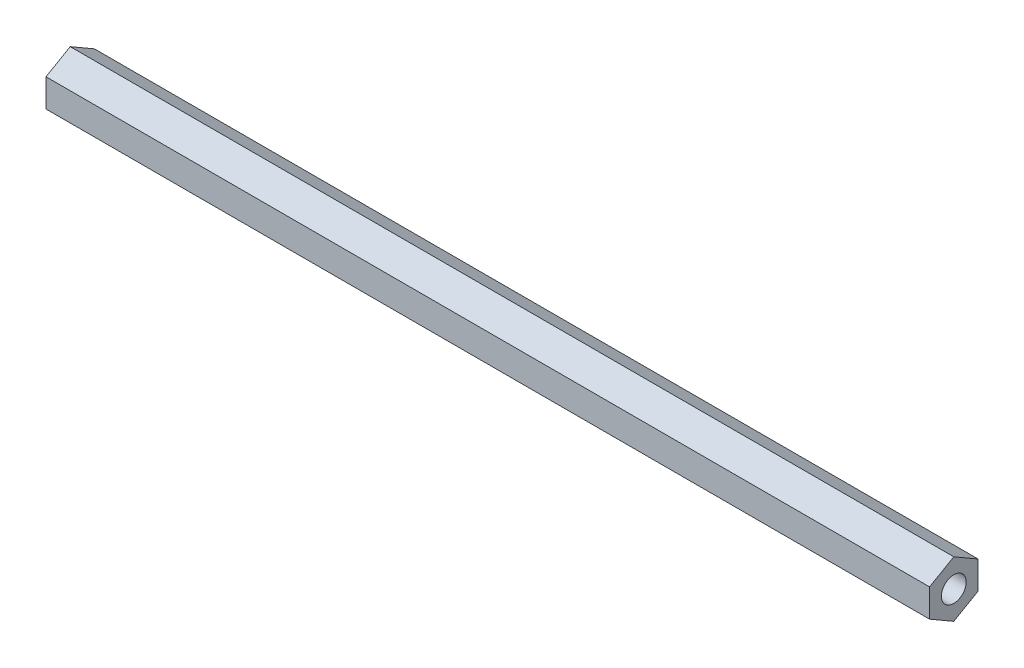
ISO-10303-21;
HEADER;
FILE_DESCRIPTION(('STEP AP214'),'2;1');
FILE_NAME('part.step','',(''),(''),'','','');
FILE_SCHEMA(('AUTOMOTIVE_DESIGN { 1 0 10303 214 1 1 1 1 }'));
ENDSEC;
DATA;
#1=APPLICATION_CONTEXT('core data for automotive mechanical design processes');
#2=APPLICATION_PROTOCOL_DEFINITION('international standard','automotive_design',2000,#1);
#3=PRODUCT_CONTEXT('',#1,'mechanical');
#4=PRODUCT('Part','Part','',(#3));
#5=PRODUCT_RELATED_PRODUCT_CATEGORY('part','',(#4));
#6=PRODUCT_DEFINITION_FORMATION('','',#4);
#7=PRODUCT_DEFINITION_CONTEXT('part definition',#1,'design');
#8=PRODUCT_DEFINITION('design','',#6,#7);
#9=PRODUCT_DEFINITION_SHAPE('','',#8);
#10=(LENGTH_UNIT() NAMED_UNIT(*) SI_UNIT(.MILLI.,.METRE.));
#11=(NAMED_UNIT(*) PLANE_ANGLE_UNIT() SI_UNIT($,.RADIAN.));
#12=(NAMED_UNIT(*) SI_UNIT($,.STERADIAN.) SOLID_ANGLE_UNIT());
#13=UNCERTAINTY_MEASURE_WITH_UNIT(LENGTH_MEASURE(1.E-05),#10,'distance_accuracy_value','');
#14=(GEOMETRIC_REPRESENTATION_CONTEXT(3) GLOBAL_UNCERTAINTY_ASSIGNED_CONTEXT((#13)) GLOBAL_UNIT_ASSIGNED_CONTEXT((#10,
#11,#12)) REPRESENTATION_CONTEXT('',''));
#15=CARTESIAN_POINT('',(0.,0.,0.));
#16=DIRECTION('',(0.,0.,1.));
#17=DIRECTION('',(1.,0.,0.));
#18=AXIS2_PLACEMENT_3D('',#15,#16,#17);
#19=CARTESIAN_POINT('',(231.775,3.66617420935419,-6.34999999999995));
#20=DIRECTION('',(0.,-0.866025403784442,0.499999999999995));
#21=DIRECTION('',(0.,-0.499999999999995,-0.866025403784442));
#22=AXIS2_PLACEMENT_3D('',#19,#20,#21);
#23=PLANE('',#22);
#24=DIRECTION('',(0.,0.499999999999995,0.866025403784442));
#25=VECTOR('',#24,1.);
#26=CARTESIAN_POINT('',(0.,3.66617420935419,-6.34999999999995));
#27=LINE('',#26,#25);
#28=CARTESIAN_POINT('',(0.,3.66617420935419,-6.34999999999995));
#29=VERTEX_POINT('',#28);
#30=CARTESIAN_POINT('',(0.,7.33234841870824,0.));
#31=VERTEX_POINT('',#30);
#32=EDGE_CURVE('E124',#29,#31,#27,.T.);
#33=ORIENTED_EDGE('',*,*,#32,.T.);
#34=DIRECTION('',(-1.,0.,0.));
#35=VECTOR('',#34,1.);
#36=CARTESIAN_POINT('',(231.775,7.33234841870824,0.));
#37=LINE('',#36,#35);
#38=CARTESIAN_POINT('',(231.775,7.33234841870824,0.));
#39=VERTEX_POINT('',#38);
#40=EDGE_CURVE('E11',#39,#31,#37,.T.);
#41=ORIENTED_EDGE('',*,*,#40,.F.);
#42=DIRECTION('',(0.,0.499999999999995,0.866025403784442));
#43=VECTOR('',#42,1.);
#44=CARTESIAN_POINT('',(231.775,3.66617420935419,-6.34999999999995));
#45=LINE('',#44,#43);
#46=CARTESIAN_POINT('',(231.775,3.66617420935419,-6.34999999999995));
#47=VERTEX_POINT('',#46);
#48=EDGE_CURVE('E135',#47,#39,#45,.T.);
#49=ORIENTED_EDGE('',*,*,#48,.F.);
#50=DIRECTION('',(-1.,0.,0.));
#51=VECTOR('',#50,1.);
#52=CARTESIAN_POINT('',(231.775,3.66617420935419,-6.34999999999995));
#53=LINE('',#52,#51);
#54=EDGE_CURVE('E120',#47,#29,#53,.T.);
#55=ORIENTED_EDGE('',*,*,#54,.T.);
#56=EDGE_LOOP('',(#33,#41,#49,#55));
#57=FACE_BOUND('',#56,.T.);
#58=ADVANCED_FACE('F40',(#57),#23,.F.);
#59=CARTESIAN_POINT('',(231.775,7.33234841870824,0.));
#60=DIRECTION('',(0.,-0.866025403784438,-0.500000000000001));
#61=DIRECTION('',(0.,0.500000000000001,-0.866025403784438));
#62=AXIS2_PLACEMENT_3D('',#59,#60,#61);
#63=PLANE('',#62);
#64=DIRECTION('',(0.,-0.500000000000001,0.866025403784438));
#65=VECTOR('',#64,1.);
#66=CARTESIAN_POINT('',(0.,7.33234841870824,0.));
#67=LINE('',#66,#65);
#68=CARTESIAN_POINT('',(0.,3.6661742093541,6.35));
#69=VERTEX_POINT('',#68);
#70=EDGE_CURVE('E127',#31,#69,#67,.T.);
#71=ORIENTED_EDGE('',*,*,#70,.T.);
#72=DIRECTION('',(-1.,0.,0.));
#73=VECTOR('',#72,1.);
#74=CARTESIAN_POINT('',(231.775,3.6661742093541,6.35));
#75=LINE('',#74,#73);
#76=CARTESIAN_POINT('',(231.775,3.6661742093541,6.35));
#77=VERTEX_POINT('',#76);
#78=EDGE_CURVE('E48',#77,#69,#75,.T.);
#79=ORIENTED_EDGE('',*,*,#78,.F.);
#80=DIRECTION('',(0.,-0.500000000000001,0.866025403784438));
#81=VECTOR('',#80,1.);
#82=CARTESIAN_POINT('',(231.775,7.33234841870824,0.));
#83=LINE('',#82,#81);
#84=EDGE_CURVE('E93',#39,#77,#83,.T.);
#85=ORIENTED_EDGE('',*,*,#84,.F.);
#86=ORIENTED_EDGE('',*,*,#40,.T.);
#87=EDGE_LOOP('',(#71,#79,#85,#86));
#88=FACE_BOUND('',#87,.T.);
#89=ADVANCED_FACE('F160',(#88),#63,.F.);
#90=CARTESIAN_POINT('',(231.775,3.6661742093541,6.35));
#91=DIRECTION('',(0.,0.,-1.));
#92=DIRECTION('',(0.,1.,0.));
#93=AXIS2_PLACEMENT_3D('',#90,#91,#92);
#94=PLANE('',#93);
#95=DIRECTION('',(0.,-1.,0.));
#96=VECTOR('',#95,1.);
#97=CARTESIAN_POINT('',(0.,3.6661742093541,6.35));
#98=LINE('',#97,#96);
#99=CARTESIAN_POINT('',(0.,-3.66617420935415,6.34999999999997));
#100=VERTEX_POINT('',#99);
#101=EDGE_CURVE('E130',#69,#100,#98,.T.);
#102=ORIENTED_EDGE('',*,*,#101,.T.);
#103=DIRECTION('',(-1.,0.,0.));
#104=VECTOR('',#103,1.);
#105=CARTESIAN_POINT('',(231.775,-3.66617420935415,6.34999999999997));
#106=LINE('',#105,#104);
#107=CARTESIAN_POINT('',(231.775,-3.66617420935415,6.34999999999997));
#108=VERTEX_POINT('',#107);
#109=EDGE_CURVE('E115',#108,#100,#106,.T.);
#110=ORIENTED_EDGE('',*,*,#109,.F.);
#111=DIRECTION('',(0.,-1.,0.));
#112=VECTOR('',#111,1.);
#113=CARTESIAN_POINT('',(231.775,3.6661742093541,6.35));
#114=LINE('',#113,#112);
#115=EDGE_CURVE('E106',#77,#108,#114,.T.);
#116=ORIENTED_EDGE('',*,*,#115,.F.);
#117=ORIENTED_EDGE('',*,*,#78,.T.);
#118=EDGE_LOOP('',(#102,#110,#116,#117));
#119=FACE_BOUND('',#118,.T.);
#120=ADVANCED_FACE('F141',(#119),#94,.F.);
#121=CARTESIAN_POINT('',(231.775,-3.66617420935415,6.34999999999997));
#122=DIRECTION('',(0.,0.866025403784442,-0.499999999999995));
#123=DIRECTION('',(0.,0.499999999999995,0.866025403784442));
#124=AXIS2_PLACEMENT_3D('',#121,#122,#123);
#125=PLANE('',#124);
#126=DIRECTION('',(0.,-0.499999999999995,-0.866025403784442));
#127=VECTOR('',#126,1.);
#128=CARTESIAN_POINT('',(0.,-3.66617420935415,6.34999999999997));
#129=LINE('',#128,#127);
#130=CARTESIAN_POINT('',(0.,-7.33234841870823,0.));
#131=VERTEX_POINT('',#130);
#132=EDGE_CURVE('E114',#100,#131,#129,.T.);
#133=ORIENTED_EDGE('',*,*,#132,.T.);
#134=DIRECTION('',(-1.,0.,0.));
#135=VECTOR('',#134,1.);
#136=CARTESIAN_POINT('',(231.775,-7.33234841870823,0.));
#137=LINE('',#136,#135);
#138=CARTESIAN_POINT('',(231.775,-7.33234841870823,0.));
#139=VERTEX_POINT('',#138);
#140=EDGE_CURVE('E111',#139,#131,#137,.T.);
#141=ORIENTED_EDGE('',*,*,#140,.F.);
#142=DIRECTION('',(0.,-0.499999999999995,-0.866025403784442));
#143=VECTOR('',#142,1.);
#144=CARTESIAN_POINT('',(231.775,-3.66617420935415,6.34999999999997));
#145=LINE('',#144,#143);
#146=EDGE_CURVE('E100',#108,#139,#145,.T.);
#147=ORIENTED_EDGE('',*,*,#146,.F.);
#148=ORIENTED_EDGE('',*,*,#109,.T.);
#149=EDGE_LOOP('',(#133,#141,#147,#148));
#150=FACE_BOUND('',#149,.T.);
#151=ADVANCED_FACE('F112',(#150),#125,.F.);
#152=CARTESIAN_POINT('',(231.775,-7.33234841870823,0.));
#153=DIRECTION('',(0.,0.866025403784435,0.500000000000007));
#154=DIRECTION('',(0.,-0.500000000000007,0.866025403784435));
#155=AXIS2_PLACEMENT_3D('',#152,#153,#154);
#156=PLANE('',#155);
#157=DIRECTION('',(0.,0.500000000000007,-0.866025403784435));
#158=VECTOR('',#157,1.);
#159=CARTESIAN_POINT('',(0.,-7.33234841870823,0.));
#160=LINE('',#159,#158);
#161=CARTESIAN_POINT('',(0.,-3.66617420935406,-6.35000000000002));
#162=VERTEX_POINT('',#161);
#163=EDGE_CURVE('E79',#131,#162,#160,.T.);
#164=ORIENTED_EDGE('',*,*,#163,.T.);
#165=DIRECTION('',(-1.,0.,0.));
#166=VECTOR('',#165,1.);
#167=CARTESIAN_POINT('',(231.775,-3.66617420935406,-6.35000000000002));
#168=LINE('',#167,#166);
#169=CARTESIAN_POINT('',(231.775,-3.66617420935406,-6.35000000000002));
#170=VERTEX_POINT('',#169);
#171=EDGE_CURVE('E116',#170,#162,#168,.T.);
#172=ORIENTED_EDGE('',*,*,#171,.F.);
#173=DIRECTION('',(0.,0.500000000000007,-0.866025403784435));
#174=VECTOR('',#173,1.);
#175=CARTESIAN_POINT('',(231.775,-7.33234841870823,0.));
#176=LINE('',#175,#174);
#177=EDGE_CURVE('E104',#139,#170,#176,.T.);
#178=ORIENTED_EDGE('',*,*,#177,.F.);
#179=ORIENTED_EDGE('',*,*,#140,.T.);
#180=EDGE_LOOP('',(#164,#172,#178,#179));
#181=FACE_BOUND('',#180,.T.);
#182=ADVANCED_FACE('F118',(#181),#156,.F.);
#183=CARTESIAN_POINT('',(231.775,-3.66617420935406,-6.35000000000002));
#184=DIRECTION('',(0.,0.,1.));
#185=DIRECTION('',(0.,-1.,0.));
#186=AXIS2_PLACEMENT_3D('',#183,#184,#185);
#187=PLANE('',#186);
#188=DIRECTION('',(0.,1.,0.));
#189=VECTOR('',#188,1.);
#190=CARTESIAN_POINT('',(0.,-3.66617420935406,-6.35000000000002));
#191=LINE('',#190,#189);
#192=EDGE_CURVE('E85',#162,#29,#191,.T.);
#193=ORIENTED_EDGE('',*,*,#192,.T.);
#194=ORIENTED_EDGE('',*,*,#54,.F.);
#195=DIRECTION('',(0.,1.,0.));
#196=VECTOR('',#195,1.);
#197=CARTESIAN_POINT('',(231.775,-3.66617420935406,-6.35000000000002));
#198=LINE('',#197,#196);
#199=EDGE_CURVE('E56',#170,#47,#198,.T.);
#200=ORIENTED_EDGE('',*,*,#199,.F.);
#201=ORIENTED_EDGE('',*,*,#171,.T.);
#202=EDGE_LOOP('',(#193,#194,#200,#201));
#203=FACE_BOUND('',#202,.T.);
#204=ADVANCED_FACE('F148',(#203),#187,.F.);
#205=CARTESIAN_POINT('',(231.775,0.,0.));
#206=DIRECTION('',(1.,0.,0.));
#207=DIRECTION('',(0.,0.,-1.));
#208=AXIS2_PLACEMENT_3D('',#205,#206,#207);
#209=PLANE('',#208);
#210=CARTESIAN_POINT('',(231.775,0.,0.));
#211=DIRECTION('',(1.,0.,0.));
#212=DIRECTION('',(0.,0.,-1.));
#213=AXIS2_PLACEMENT_3D('',#210,#211,#212);
#214=CIRCLE('',#213,3.2639);
#215=CARTESIAN_POINT('',(231.775,0.,-3.2639));
#216=VERTEX_POINT('',#215);
#217=EDGE_CURVE('E243',#216,#216,#214,.T.);
#218=ORIENTED_EDGE('',*,*,#217,.F.);
#219=EDGE_LOOP('',(#218));
#220=FACE_BOUND('',#219,.T.);
#221=ORIENTED_EDGE('',*,*,#48,.T.);
#222=ORIENTED_EDGE('',*,*,#84,.T.);
#223=ORIENTED_EDGE('',*,*,#115,.T.);
#224=ORIENTED_EDGE('',*,*,#146,.T.);
#225=ORIENTED_EDGE('',*,*,#177,.T.);
#226=ORIENTED_EDGE('',*,*,#199,.T.);
#227=EDGE_LOOP('',(#221,#222,#223,#224,#225,#226));
#228=FACE_BOUND('',#227,.T.);
#229=ADVANCED_FACE('F102',(#220,#228),#209,.T.);
#230=CARTESIAN_POINT('',(0.,0.,0.));
#231=DIRECTION('',(1.,0.,0.));
#232=DIRECTION('',(0.,0.,-1.));
#233=AXIS2_PLACEMENT_3D('',#230,#231,#232);
#234=PLANE('',#233);
#235=CARTESIAN_POINT('',(0.,0.,0.));
#236=DIRECTION('',(-1.,0.,0.));
#237=DIRECTION('',(0.,0.,1.));
#238=AXIS2_PLACEMENT_3D('',#235,#236,#237);
#239=CIRCLE('',#238,3.2639);
#240=CARTESIAN_POINT('',(0.,0.,3.2639));
#241=VERTEX_POINT('',#240);
#242=EDGE_CURVE('E244',#241,#241,#239,.T.);
#243=ORIENTED_EDGE('',*,*,#242,.F.);
#244=EDGE_LOOP('',(#243));
#245=FACE_BOUND('',#244,.T.);
#246=ORIENTED_EDGE('',*,*,#32,.F.);
#247=ORIENTED_EDGE('',*,*,#192,.F.);
#248=ORIENTED_EDGE('',*,*,#163,.F.);
#249=ORIENTED_EDGE('',*,*,#132,.F.);
#250=ORIENTED_EDGE('',*,*,#101,.F.);
#251=ORIENTED_EDGE('',*,*,#70,.F.);
#252=EDGE_LOOP('',(#246,#247,#248,#249,#250,#251));
#253=FACE_BOUND('',#252,.T.);
#254=ADVANCED_FACE('F144',(#245,#253),#234,.F.);
#255=CARTESIAN_POINT('',(219.075,0.,0.));
#256=DIRECTION('',(1.,0.,0.));
#257=DIRECTION('',(0.,0.,-1.));
#258=AXIS2_PLACEMENT_3D('',#255,#256,#257);
#259=CYLINDRICAL_SURFACE('',#258,3.2639);
#260=CARTESIAN_POINT('',(219.075,0.,0.));
#261=DIRECTION('',(1.,0.,0.));
#262=DIRECTION('',(0.,0.,-1.));
#263=AXIS2_PLACEMENT_3D('',#260,#261,#262);
#264=CIRCLE('',#263,3.2639);
#265=CARTESIAN_POINT('',(219.075,0.,-3.2639));
#266=VERTEX_POINT('',#265);
#267=EDGE_CURVE('E128',#266,#266,#264,.T.);
#268=ORIENTED_EDGE('',*,*,#267,.F.);
#269=EDGE_LOOP('',(#268));
#270=FACE_BOUND('',#269,.T.);
#271=ORIENTED_EDGE('',*,*,#217,.T.);
#272=EDGE_LOOP('',(#271));
#273=FACE_BOUND('',#272,.T.);
#274=ADVANCED_FACE('F195',(#270,#273),#259,.F.);
#275=CARTESIAN_POINT('',(219.075,0.,0.));
#276=DIRECTION('',(1.,0.,0.));
#277=DIRECTION('',(0.,0.,-1.));
#278=AXIS2_PLACEMENT_3D('',#275,#276,#277);
#279=PLANE('',#278);
#280=ORIENTED_EDGE('',*,*,#267,.T.);
#281=EDGE_LOOP('',(#280));
#282=FACE_BOUND('',#281,.T.);
#283=ADVANCED_FACE('F200',(#282),#279,.T.);
#284=CARTESIAN_POINT('',(12.7,0.,0.));
#285=DIRECTION('',(-1.,0.,0.));
#286=DIRECTION('',(0.,0.,1.));
#287=AXIS2_PLACEMENT_3D('',#284,#285,#286);
#288=CYLINDRICAL_SURFACE('',#287,3.2639);
#289=CARTESIAN_POINT('',(12.7,0.,0.));
#290=DIRECTION('',(-1.,0.,0.));
#291=DIRECTION('',(0.,0.,1.));
#292=AXIS2_PLACEMENT_3D('',#289,#290,#291);
#293=CIRCLE('',#292,3.2639);
#294=CARTESIAN_POINT('',(12.7,0.,3.2639));
#295=VERTEX_POINT('',#294);
#296=EDGE_CURVE('E242',#295,#295,#293,.T.);
#297=ORIENTED_EDGE('',*,*,#296,.F.);
#298=EDGE_LOOP('',(#297));
#299=FACE_BOUND('',#298,.T.);
#300=ORIENTED_EDGE('',*,*,#242,.T.);
#301=EDGE_LOOP('',(#300));
#302=FACE_BOUND('',#301,.T.);
#303=ADVANCED_FACE('F210',(#299,#302),#288,.F.);
#304=CARTESIAN_POINT('',(12.7,0.,0.));
#305=DIRECTION('',(-1.,0.,0.));
#306=DIRECTION('',(0.,0.,1.));
#307=AXIS2_PLACEMENT_3D('',#304,#305,#306);
#308=PLANE('',#307);
#309=ORIENTED_EDGE('',*,*,#296,.T.);
#310=EDGE_LOOP('',(#309));
#311=FACE_BOUND('',#310,.T.);
#312=ADVANCED_FACE('F226',(#311),#308,.T.);
#313=CLOSED_SHELL('',(#58,#89,#120,#151,#182,#204,#229,#254,#274,#283,#303,#312));
#314=MANIFOLD_SOLID_BREP('B2',#313);
#315=ADVANCED_BREP_SHAPE_REPRESENTATION('',(#18,#314),#14);
#316=SHAPE_DEFINITION_REPRESENTATION(#9,#315);
ENDSEC;
END-ISO-10303-21;
